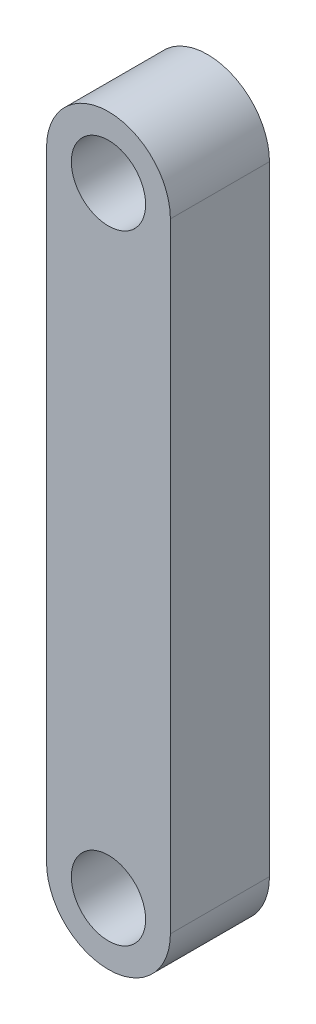
ISO-10303-21;
HEADER;
FILE_DESCRIPTION(('STEP AP214'),'2;1');
FILE_NAME('part.step','',(''),(''),'','','');
FILE_SCHEMA(('AUTOMOTIVE_DESIGN { 1 0 10303 214 1 1 1 1 }'));
ENDSEC;
DATA;
#1=APPLICATION_CONTEXT('core data for automotive mechanical design processes');
#2=APPLICATION_PROTOCOL_DEFINITION('international standard','automotive_design',2000,#1);
#3=PRODUCT_CONTEXT('',#1,'mechanical');
#4=PRODUCT('Part','Part','',(#3));
#5=PRODUCT_RELATED_PRODUCT_CATEGORY('part','',(#4));
#6=PRODUCT_DEFINITION_FORMATION('','',#4);
#7=PRODUCT_DEFINITION_CONTEXT('part definition',#1,'design');
#8=PRODUCT_DEFINITION('design','',#6,#7);
#9=PRODUCT_DEFINITION_SHAPE('','',#8);
#10=(LENGTH_UNIT() NAMED_UNIT(*) SI_UNIT(.MILLI.,.METRE.));
#11=(NAMED_UNIT(*) PLANE_ANGLE_UNIT() SI_UNIT($,.RADIAN.));
#12=(NAMED_UNIT(*) SI_UNIT($,.STERADIAN.) SOLID_ANGLE_UNIT());
#13=UNCERTAINTY_MEASURE_WITH_UNIT(LENGTH_MEASURE(1.E-05),#10,'distance_accuracy_value','');
#14=(GEOMETRIC_REPRESENTATION_CONTEXT(3) GLOBAL_UNCERTAINTY_ASSIGNED_CONTEXT((#13)) GLOBAL_UNIT_ASSIGNED_CONTEXT((#10,
#11,#12)) REPRESENTATION_CONTEXT('',''));
#15=CARTESIAN_POINT('',(0.,0.,0.));
#16=DIRECTION('',(0.,0.,1.));
#17=DIRECTION('',(1.,0.,0.));
#18=AXIS2_PLACEMENT_3D('',#15,#16,#17);
#19=CARTESIAN_POINT('',(0.,-12.5,4.));
#20=DIRECTION('',(0.,0.,1.));
#21=DIRECTION('',(1.,0.,0.));
#22=AXIS2_PLACEMENT_3D('',#19,#20,#21);
#23=PLANE('',#22);
#24=CARTESIAN_POINT('',(0.,12.5,4.));
#25=DIRECTION('',(0.,0.,1.));
#26=DIRECTION('',(1.,0.,0.));
#27=AXIS2_PLACEMENT_3D('',#24,#25,#26);
#28=CIRCLE('',#27,1.5);
#29=CARTESIAN_POINT('',(1.5,12.5,4.));
#30=VERTEX_POINT('',#29);
#31=EDGE_CURVE('E106',#30,#30,#28,.T.);
#32=ORIENTED_EDGE('',*,*,#31,.F.);
#33=EDGE_LOOP('',(#32));
#34=FACE_BOUND('',#33,.T.);
#35=CARTESIAN_POINT('',(0.,-12.5,4.));
#36=DIRECTION('',(0.,0.,1.));
#37=DIRECTION('',(1.,0.,0.));
#38=AXIS2_PLACEMENT_3D('',#35,#36,#37);
#39=CIRCLE('',#38,2.5);
#40=CARTESIAN_POINT('',(-2.5,-12.5,4.));
#41=VERTEX_POINT('',#40);
#42=CARTESIAN_POINT('',(2.5,-12.5,4.));
#43=VERTEX_POINT('',#42);
#44=EDGE_CURVE('E91',#41,#43,#39,.T.);
#45=ORIENTED_EDGE('',*,*,#44,.T.);
#46=DIRECTION('',(0.,1.,0.));
#47=VECTOR('',#46,1.);
#48=CARTESIAN_POINT('',(2.5,-12.5,4.));
#49=LINE('',#48,#47);
#50=CARTESIAN_POINT('',(2.5,12.5,4.));
#51=VERTEX_POINT('',#50);
#52=EDGE_CURVE('E86',#43,#51,#49,.T.);
#53=ORIENTED_EDGE('',*,*,#52,.T.);
#54=CARTESIAN_POINT('',(0.,12.5,4.));
#55=DIRECTION('',(0.,0.,1.));
#56=DIRECTION('',(-1.,0.,0.));
#57=AXIS2_PLACEMENT_3D('',#54,#55,#56);
#58=CIRCLE('',#57,2.5);
#59=CARTESIAN_POINT('',(-2.5,12.5,4.));
#60=VERTEX_POINT('',#59);
#61=EDGE_CURVE('E89',#51,#60,#58,.T.);
#62=ORIENTED_EDGE('',*,*,#61,.T.);
#63=DIRECTION('',(0.,-1.,0.));
#64=VECTOR('',#63,1.);
#65=CARTESIAN_POINT('',(-2.5,-12.5,4.));
#66=LINE('',#65,#64);
#67=EDGE_CURVE('E56',#60,#41,#66,.T.);
#68=ORIENTED_EDGE('',*,*,#67,.T.);
#69=EDGE_LOOP('',(#45,#53,#62,#68));
#70=FACE_BOUND('',#69,.T.);
#71=CARTESIAN_POINT('',(0.,-12.5,4.));
#72=DIRECTION('',(0.,0.,1.));
#73=DIRECTION('',(1.,0.,0.));
#74=AXIS2_PLACEMENT_3D('',#71,#72,#73);
#75=CIRCLE('',#74,1.5);
#76=CARTESIAN_POINT('',(1.5,-12.5,4.));
#77=VERTEX_POINT('',#76);
#78=EDGE_CURVE('E121',#77,#77,#75,.T.);
#79=ORIENTED_EDGE('',*,*,#78,.F.);
#80=EDGE_LOOP('',(#79));
#81=FACE_BOUND('',#80,.T.);
#82=ADVANCED_FACE('F39',(#34,#70,#81),#23,.T.);
#83=CARTESIAN_POINT('',(0.,-12.5,0.));
#84=DIRECTION('',(0.,0.,1.));
#85=DIRECTION('',(1.,0.,0.));
#86=AXIS2_PLACEMENT_3D('',#83,#84,#85);
#87=PLANE('',#86);
#88=CARTESIAN_POINT('',(0.,-12.5,0.));
#89=DIRECTION('',(0.,0.,1.));
#90=DIRECTION('',(1.,0.,0.));
#91=AXIS2_PLACEMENT_3D('',#88,#89,#90);
#92=CIRCLE('',#91,2.5);
#93=CARTESIAN_POINT('',(-2.5,-12.5,0.));
#94=VERTEX_POINT('',#93);
#95=CARTESIAN_POINT('',(2.5,-12.5,0.));
#96=VERTEX_POINT('',#95);
#97=EDGE_CURVE('E103',#94,#96,#92,.T.);
#98=ORIENTED_EDGE('',*,*,#97,.F.);
#99=DIRECTION('',(0.,-1.,0.));
#100=VECTOR('',#99,1.);
#101=CARTESIAN_POINT('',(-2.5,-12.5,0.));
#102=LINE('',#101,#100);
#103=CARTESIAN_POINT('',(-2.5,12.5,0.));
#104=VERTEX_POINT('',#103);
#105=EDGE_CURVE('E79',#104,#94,#102,.T.);
#106=ORIENTED_EDGE('',*,*,#105,.F.);
#107=CARTESIAN_POINT('',(0.,12.5,0.));
#108=DIRECTION('',(0.,0.,1.));
#109=DIRECTION('',(-1.,0.,0.));
#110=AXIS2_PLACEMENT_3D('',#107,#108,#109);
#111=CIRCLE('',#110,2.5);
#112=CARTESIAN_POINT('',(2.5,12.5,0.));
#113=VERTEX_POINT('',#112);
#114=EDGE_CURVE('E73',#113,#104,#111,.T.);
#115=ORIENTED_EDGE('',*,*,#114,.F.);
#116=DIRECTION('',(0.,1.,0.));
#117=VECTOR('',#116,1.);
#118=CARTESIAN_POINT('',(2.5,-12.5,0.));
#119=LINE('',#118,#117);
#120=EDGE_CURVE('E95',#96,#113,#119,.T.);
#121=ORIENTED_EDGE('',*,*,#120,.F.);
#122=EDGE_LOOP('',(#98,#106,#115,#121));
#123=FACE_BOUND('',#122,.T.);
#124=CARTESIAN_POINT('',(0.,12.5,0.));
#125=DIRECTION('',(0.,0.,1.));
#126=DIRECTION('',(1.,0.,0.));
#127=AXIS2_PLACEMENT_3D('',#124,#125,#126);
#128=CIRCLE('',#127,1.5);
#129=CARTESIAN_POINT('',(1.5,12.5,0.));
#130=VERTEX_POINT('',#129);
#131=EDGE_CURVE('E118',#130,#130,#128,.T.);
#132=ORIENTED_EDGE('',*,*,#131,.T.);
#133=EDGE_LOOP('',(#132));
#134=FACE_BOUND('',#133,.T.);
#135=CARTESIAN_POINT('',(0.,-12.5,0.));
#136=DIRECTION('',(0.,0.,1.));
#137=DIRECTION('',(1.,0.,0.));
#138=AXIS2_PLACEMENT_3D('',#135,#136,#137);
#139=CIRCLE('',#138,1.5);
#140=CARTESIAN_POINT('',(1.5,-12.5,0.));
#141=VERTEX_POINT('',#140);
#142=EDGE_CURVE('E124',#141,#141,#139,.T.);
#143=ORIENTED_EDGE('',*,*,#142,.T.);
#144=EDGE_LOOP('',(#143));
#145=FACE_BOUND('',#144,.T.);
#146=ADVANCED_FACE('F114',(#123,#134,#145),#87,.F.);
#147=CARTESIAN_POINT('',(0.,-12.5,4.));
#148=DIRECTION('',(0.,0.,-1.));
#149=DIRECTION('',(-1.,0.,0.));
#150=AXIS2_PLACEMENT_3D('',#147,#148,#149);
#151=CYLINDRICAL_SURFACE('',#150,2.5);
#152=ORIENTED_EDGE('',*,*,#97,.T.);
#153=DIRECTION('',(0.,0.,-1.));
#154=VECTOR('',#153,1.);
#155=CARTESIAN_POINT('',(2.5,-12.5,4.));
#156=LINE('',#155,#154);
#157=EDGE_CURVE('E11',#43,#96,#156,.T.);
#158=ORIENTED_EDGE('',*,*,#157,.F.);
#159=ORIENTED_EDGE('',*,*,#44,.F.);
#160=DIRECTION('',(0.,0.,-1.));
#161=VECTOR('',#160,1.);
#162=CARTESIAN_POINT('',(-2.5,-12.5,4.));
#163=LINE('',#162,#161);
#164=EDGE_CURVE('E99',#41,#94,#163,.T.);
#165=ORIENTED_EDGE('',*,*,#164,.T.);
#166=EDGE_LOOP('',(#152,#158,#159,#165));
#167=FACE_BOUND('',#166,.T.);
#168=ADVANCED_FACE('F41',(#167),#151,.T.);
#169=CARTESIAN_POINT('',(2.5,-12.5,4.));
#170=DIRECTION('',(-1.,0.,0.));
#171=DIRECTION('',(0.,0.,1.));
#172=AXIS2_PLACEMENT_3D('',#169,#170,#171);
#173=PLANE('',#172);
#174=ORIENTED_EDGE('',*,*,#120,.T.);
#175=DIRECTION('',(0.,0.,-1.));
#176=VECTOR('',#175,1.);
#177=CARTESIAN_POINT('',(2.5,12.5,4.));
#178=LINE('',#177,#176);
#179=EDGE_CURVE('E48',#51,#113,#178,.T.);
#180=ORIENTED_EDGE('',*,*,#179,.F.);
#181=ORIENTED_EDGE('',*,*,#52,.F.);
#182=ORIENTED_EDGE('',*,*,#157,.T.);
#183=EDGE_LOOP('',(#174,#180,#181,#182));
#184=FACE_BOUND('',#183,.T.);
#185=ADVANCED_FACE('F94',(#184),#173,.F.);
#186=CARTESIAN_POINT('',(0.,12.5,4.));
#187=DIRECTION('',(0.,0.,-1.));
#188=DIRECTION('',(-1.,0.,0.));
#189=AXIS2_PLACEMENT_3D('',#186,#187,#188);
#190=CYLINDRICAL_SURFACE('',#189,2.5);
#191=ORIENTED_EDGE('',*,*,#114,.T.);
#192=DIRECTION('',(0.,0.,-1.));
#193=VECTOR('',#192,1.);
#194=CARTESIAN_POINT('',(-2.5,12.5,4.));
#195=LINE('',#194,#193);
#196=EDGE_CURVE('E96',#60,#104,#195,.T.);
#197=ORIENTED_EDGE('',*,*,#196,.F.);
#198=ORIENTED_EDGE('',*,*,#61,.F.);
#199=ORIENTED_EDGE('',*,*,#179,.T.);
#200=EDGE_LOOP('',(#191,#197,#198,#199));
#201=FACE_BOUND('',#200,.T.);
#202=ADVANCED_FACE('F97',(#201),#190,.T.);
#203=CARTESIAN_POINT('',(-2.5,-12.5,4.));
#204=DIRECTION('',(1.,0.,0.));
#205=DIRECTION('',(0.,0.,-1.));
#206=AXIS2_PLACEMENT_3D('',#203,#204,#205);
#207=PLANE('',#206);
#208=ORIENTED_EDGE('',*,*,#105,.T.);
#209=ORIENTED_EDGE('',*,*,#164,.F.);
#210=ORIENTED_EDGE('',*,*,#67,.F.);
#211=ORIENTED_EDGE('',*,*,#196,.T.);
#212=EDGE_LOOP('',(#208,#209,#210,#211));
#213=FACE_BOUND('',#212,.T.);
#214=ADVANCED_FACE('F111',(#213),#207,.F.);
#215=CARTESIAN_POINT('',(0.,12.5,4.));
#216=DIRECTION('',(0.,0.,-1.));
#217=DIRECTION('',(-1.,0.,0.));
#218=AXIS2_PLACEMENT_3D('',#215,#216,#217);
#219=CYLINDRICAL_SURFACE('',#218,1.5);
#220=ORIENTED_EDGE('',*,*,#31,.T.);
#221=EDGE_LOOP('',(#220));
#222=FACE_BOUND('',#221,.T.);
#223=ORIENTED_EDGE('',*,*,#131,.F.);
#224=EDGE_LOOP('',(#223));
#225=FACE_BOUND('',#224,.T.);
#226=ADVANCED_FACE('F141',(#222,#225),#219,.F.);
#227=CARTESIAN_POINT('',(0.,-12.5,4.));
#228=DIRECTION('',(0.,0.,-1.));
#229=DIRECTION('',(-1.,0.,0.));
#230=AXIS2_PLACEMENT_3D('',#227,#228,#229);
#231=CYLINDRICAL_SURFACE('',#230,1.5);
#232=ORIENTED_EDGE('',*,*,#78,.T.);
#233=EDGE_LOOP('',(#232));
#234=FACE_BOUND('',#233,.T.);
#235=ORIENTED_EDGE('',*,*,#142,.F.);
#236=EDGE_LOOP('',(#235));
#237=FACE_BOUND('',#236,.T.);
#238=ADVANCED_FACE('F130',(#234,#237),#231,.F.);
#239=CLOSED_SHELL('',(#82,#146,#168,#185,#202,#214,#226,#238));
#240=MANIFOLD_SOLID_BREP('B2',#239);
#241=ADVANCED_BREP_SHAPE_REPRESENTATION('',(#18,#240),#14);
#242=SHAPE_DEFINITION_REPRESENTATION(#9,#241);
ENDSEC;
END-ISO-10303-21;
